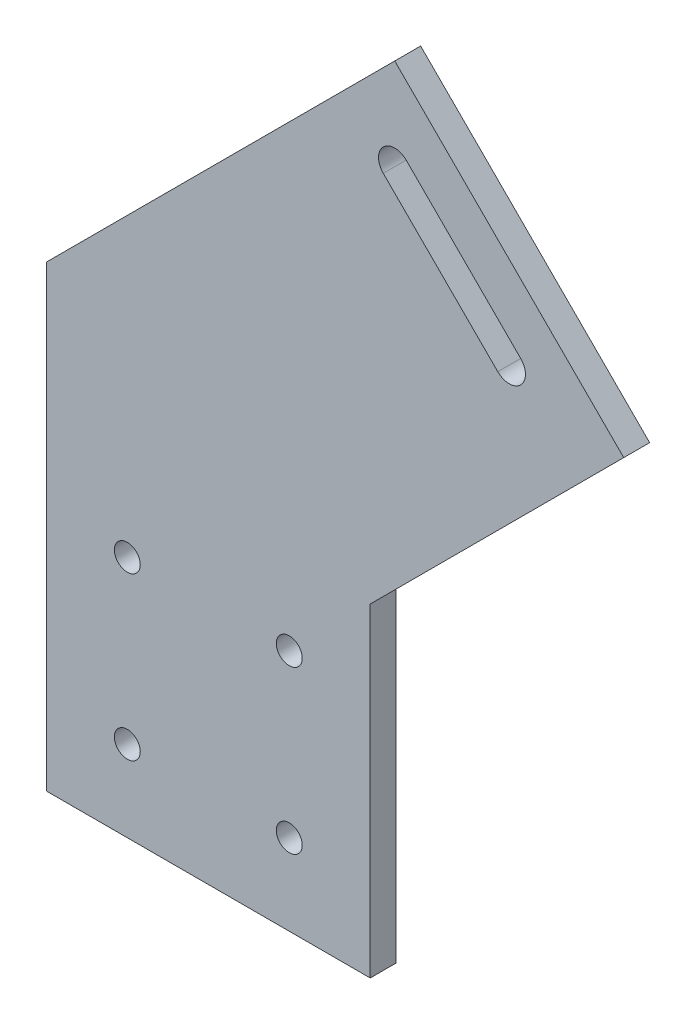
ISO-10303-21;
HEADER;
FILE_DESCRIPTION(('STEP AP214'),'2;1');
FILE_NAME('part.step','',(''),(''),'','','');
FILE_SCHEMA(('AUTOMOTIVE_DESIGN { 1 0 10303 214 1 1 1 1 }'));
ENDSEC;
DATA;
#1=APPLICATION_CONTEXT('core data for automotive mechanical design processes');
#2=APPLICATION_PROTOCOL_DEFINITION('international standard','automotive_design',2000,#1);
#3=PRODUCT_CONTEXT('',#1,'mechanical');
#4=PRODUCT('Part','Part','',(#3));
#5=PRODUCT_RELATED_PRODUCT_CATEGORY('part','',(#4));
#6=PRODUCT_DEFINITION_FORMATION('','',#4);
#7=PRODUCT_DEFINITION_CONTEXT('part definition',#1,'design');
#8=PRODUCT_DEFINITION('design','',#6,#7);
#9=PRODUCT_DEFINITION_SHAPE('','',#8);
#10=(LENGTH_UNIT() NAMED_UNIT(*) SI_UNIT(.MILLI.,.METRE.));
#11=(NAMED_UNIT(*) PLANE_ANGLE_UNIT() SI_UNIT($,.RADIAN.));
#12=(NAMED_UNIT(*) SI_UNIT($,.STERADIAN.) SOLID_ANGLE_UNIT());
#13=UNCERTAINTY_MEASURE_WITH_UNIT(LENGTH_MEASURE(1.E-05),#10,'distance_accuracy_value','');
#14=(GEOMETRIC_REPRESENTATION_CONTEXT(3) GLOBAL_UNCERTAINTY_ASSIGNED_CONTEXT((#13)) GLOBAL_UNIT_ASSIGNED_CONTEXT((#10,
#11,#12)) REPRESENTATION_CONTEXT('',''));
#15=CARTESIAN_POINT('',(0.,0.,0.));
#16=DIRECTION('',(0.,0.,1.));
#17=DIRECTION('',(1.,0.,0.));
#18=AXIS2_PLACEMENT_3D('',#15,#16,#17);
#19=CARTESIAN_POINT('',(0.,0.,4.));
#20=DIRECTION('',(0.,0.,-1.));
#21=DIRECTION('',(-1.,0.,0.));
#22=AXIS2_PLACEMENT_3D('',#19,#20,#21);
#23=PLANE('',#22);
#24=DIRECTION('',(0.,-1.,0.));
#25=VECTOR('',#24,1.);
#26=CARTESIAN_POINT('',(-25.,40.,4.));
#27=LINE('',#26,#25);
#28=CARTESIAN_POINT('',(-25.,60.7106781186547,4.));
#29=VERTEX_POINT('',#28);
#30=CARTESIAN_POINT('',(-25.,-9.99999999999999,4.));
#31=VERTEX_POINT('',#30);
#32=EDGE_CURVE('E153',#29,#31,#27,.T.);
#33=ORIENTED_EDGE('',*,*,#32,.T.);
#34=DIRECTION('',(1.,0.,0.));
#35=VECTOR('',#34,1.);
#36=CARTESIAN_POINT('',(-25.,-9.99999999999999,4.));
#37=LINE('',#36,#35);
#38=CARTESIAN_POINT('',(25.,-9.99999999999999,4.));
#39=VERTEX_POINT('',#38);
#40=EDGE_CURVE('E155',#31,#39,#37,.T.);
#41=ORIENTED_EDGE('',*,*,#40,.T.);
#42=DIRECTION('',(0.,1.,0.));
#43=VECTOR('',#42,1.);
#44=CARTESIAN_POINT('',(25.,-9.99999999999999,4.));
#45=LINE('',#44,#43);
#46=CARTESIAN_POINT('',(25.,40.,4.));
#47=VERTEX_POINT('',#46);
#48=EDGE_CURVE('E158',#39,#47,#45,.T.);
#49=ORIENTED_EDGE('',*,*,#48,.T.);
#50=DIRECTION('',(0.707106781186549,0.707106781186546,0.));
#51=VECTOR('',#50,1.);
#52=CARTESIAN_POINT('',(25.,40.,4.));
#53=LINE('',#52,#51);
#54=CARTESIAN_POINT('',(64.1386172558174,79.1386172558173,4.));
#55=VERTEX_POINT('',#54);
#56=EDGE_CURVE('E160',#47,#55,#53,.T.);
#57=ORIENTED_EDGE('',*,*,#56,.T.);
#58=DIRECTION('',(-0.707106781186548,0.707106781186547,0.));
#59=VECTOR('',#58,1.);
#60=CARTESIAN_POINT('',(28.7832781964899,114.493956315145,4.));
#61=LINE('',#60,#59);
#62=CARTESIAN_POINT('',(28.7832781964899,114.493956315145,4.));
#63=VERTEX_POINT('',#62);
#64=EDGE_CURVE('E162',#55,#63,#61,.T.);
#65=ORIENTED_EDGE('',*,*,#64,.T.);
#66=DIRECTION('',(-0.707106781186548,-0.707106781186547,0.));
#67=VECTOR('',#66,1.);
#68=CARTESIAN_POINT('',(28.7832781964899,114.493956315145,4.));
#69=LINE('',#68,#67);
#70=EDGE_CURVE('E164',#63,#29,#69,.T.);
#71=ORIENTED_EDGE('',*,*,#70,.T.);
#72=EDGE_LOOP('',(#33,#41,#49,#57,#65,#71));
#73=FACE_BOUND('',#72,.T.);
#74=CARTESIAN_POINT('',(46.4609477261536,82.67415116175,4.));
#75=DIRECTION('',(0.,0.,1.));
#76=DIRECTION('',(1.,0.,0.));
#77=AXIS2_PLACEMENT_3D('',#74,#75,#76);
#78=CIRCLE('',#77,2.5);
#79=CARTESIAN_POINT('',(44.6931807731872,80.9063842087836,4.));
#80=VERTEX_POINT('',#79);
#81=CARTESIAN_POINT('',(48.22871467912,84.4419181147164,4.));
#82=VERTEX_POINT('',#81);
#83=EDGE_CURVE('E114',#80,#82,#78,.T.);
#84=ORIENTED_EDGE('',*,*,#83,.F.);
#85=DIRECTION('',(0.707106781186548,-0.707106781186547,0.));
#86=VECTOR('',#85,1.);
#87=CARTESIAN_POINT('',(27.0155112435235,98.5840537384473,4.));
#88=LINE('',#87,#86);
#89=CARTESIAN_POINT('',(27.0155112435235,98.5840537384473,4.));
#90=VERTEX_POINT('',#89);
#91=EDGE_CURVE('E137',#90,#80,#88,.T.);
#92=ORIENTED_EDGE('',*,*,#91,.F.);
#93=CARTESIAN_POINT('',(28.7832781964899,100.351820691414,4.));
#94=DIRECTION('',(0.,0.,1.));
#95=DIRECTION('',(1.,0.,0.));
#96=AXIS2_PLACEMENT_3D('',#93,#94,#95);
#97=CIRCLE('',#96,2.50000000000001);
#98=CARTESIAN_POINT('',(30.5510451494563,102.11958764438,4.));
#99=VERTEX_POINT('',#98);
#100=EDGE_CURVE('E135',#99,#90,#97,.T.);
#101=ORIENTED_EDGE('',*,*,#100,.F.);
#102=DIRECTION('',(-0.707106781186547,0.707106781186548,0.));
#103=VECTOR('',#102,1.);
#104=CARTESIAN_POINT('',(48.22871467912,84.4419181147164,4.));
#105=LINE('',#104,#103);
#106=EDGE_CURVE('E122',#82,#99,#105,.T.);
#107=ORIENTED_EDGE('',*,*,#106,.F.);
#108=EDGE_LOOP('',(#84,#92,#101,#107));
#109=FACE_BOUND('',#108,.T.);
#110=CARTESIAN_POINT('',(-12.5,27.5,4.));
#111=DIRECTION('',(0.,0.,1.));
#112=DIRECTION('',(1.,0.,0.));
#113=AXIS2_PLACEMENT_3D('',#110,#111,#112);
#114=CIRCLE('',#113,2.);
#115=CARTESIAN_POINT('',(-10.5,27.5,4.));
#116=VERTEX_POINT('',#115);
#117=EDGE_CURVE('E143',#116,#116,#114,.T.);
#118=ORIENTED_EDGE('',*,*,#117,.F.);
#119=EDGE_LOOP('',(#118));
#120=FACE_BOUND('',#119,.T.);
#121=CARTESIAN_POINT('',(12.5,27.5,4.));
#122=DIRECTION('',(0.,0.,1.));
#123=DIRECTION('',(1.,0.,0.));
#124=AXIS2_PLACEMENT_3D('',#121,#122,#123);
#125=CIRCLE('',#124,2.);
#126=CARTESIAN_POINT('',(14.5,27.5,4.));
#127=VERTEX_POINT('',#126);
#128=EDGE_CURVE('E281',#127,#127,#125,.T.);
#129=ORIENTED_EDGE('',*,*,#128,.F.);
#130=EDGE_LOOP('',(#129));
#131=FACE_BOUND('',#130,.T.);
#132=CARTESIAN_POINT('',(12.5,2.5,4.));
#133=DIRECTION('',(0.,0.,1.));
#134=DIRECTION('',(1.,0.,0.));
#135=AXIS2_PLACEMENT_3D('',#132,#133,#134);
#136=CIRCLE('',#135,2.);
#137=CARTESIAN_POINT('',(14.5,2.5,4.));
#138=VERTEX_POINT('',#137);
#139=EDGE_CURVE('E275',#138,#138,#136,.T.);
#140=ORIENTED_EDGE('',*,*,#139,.F.);
#141=EDGE_LOOP('',(#140));
#142=FACE_BOUND('',#141,.T.);
#143=CARTESIAN_POINT('',(-12.5,2.5,4.));
#144=DIRECTION('',(0.,0.,1.));
#145=DIRECTION('',(1.,0.,0.));
#146=AXIS2_PLACEMENT_3D('',#143,#144,#145);
#147=CIRCLE('',#146,2.);
#148=CARTESIAN_POINT('',(-10.5,2.5,4.));
#149=VERTEX_POINT('',#148);
#150=EDGE_CURVE('E266',#149,#149,#147,.T.);
#151=ORIENTED_EDGE('',*,*,#150,.F.);
#152=EDGE_LOOP('',(#151));
#153=FACE_BOUND('',#152,.T.);
#154=ADVANCED_FACE('F37',(#73,#109,#120,#131,#142,#153),#23,.F.);
#155=CARTESIAN_POINT('',(0.,0.,0.));
#156=DIRECTION('',(0.,0.,-1.));
#157=DIRECTION('',(-1.,0.,0.));
#158=AXIS2_PLACEMENT_3D('',#155,#156,#157);
#159=PLANE('',#158);
#160=CARTESIAN_POINT('',(12.5,2.5,0.));
#161=DIRECTION('',(0.,0.,1.));
#162=DIRECTION('',(1.,0.,0.));
#163=AXIS2_PLACEMENT_3D('',#160,#161,#162);
#164=CIRCLE('',#163,2.);
#165=CARTESIAN_POINT('',(14.5,2.5,0.));
#166=VERTEX_POINT('',#165);
#167=EDGE_CURVE('E272',#166,#166,#164,.T.);
#168=ORIENTED_EDGE('',*,*,#167,.T.);
#169=EDGE_LOOP('',(#168));
#170=FACE_BOUND('',#169,.T.);
#171=CARTESIAN_POINT('',(-12.5,27.5,0.));
#172=DIRECTION('',(0.,0.,1.));
#173=DIRECTION('',(1.,0.,0.));
#174=AXIS2_PLACEMENT_3D('',#171,#172,#173);
#175=CIRCLE('',#174,2.);
#176=CARTESIAN_POINT('',(-10.5,27.5,0.));
#177=VERTEX_POINT('',#176);
#178=EDGE_CURVE('E284',#177,#177,#175,.T.);
#179=ORIENTED_EDGE('',*,*,#178,.T.);
#180=EDGE_LOOP('',(#179));
#181=FACE_BOUND('',#180,.T.);
#182=DIRECTION('',(0.,-1.,0.));
#183=VECTOR('',#182,1.);
#184=CARTESIAN_POINT('',(-25.,-9.99999999999999,0.));
#185=LINE('',#184,#183);
#186=CARTESIAN_POINT('',(-25.,60.7106781186547,0.));
#187=VERTEX_POINT('',#186);
#188=CARTESIAN_POINT('',(-25.,-9.99999999999999,0.));
#189=VERTEX_POINT('',#188);
#190=EDGE_CURVE('E130',#187,#189,#185,.T.);
#191=ORIENTED_EDGE('',*,*,#190,.F.);
#192=DIRECTION('',(-0.707106781186548,-0.707106781186547,0.));
#193=VECTOR('',#192,1.);
#194=CARTESIAN_POINT('',(28.7832781964899,114.493956315145,0.));
#195=LINE('',#194,#193);
#196=CARTESIAN_POINT('',(28.7832781964899,114.493956315145,0.));
#197=VERTEX_POINT('',#196);
#198=EDGE_CURVE('E156',#197,#187,#195,.T.);
#199=ORIENTED_EDGE('',*,*,#198,.F.);
#200=DIRECTION('',(-0.707106781186548,0.707106781186547,0.));
#201=VECTOR('',#200,1.);
#202=CARTESIAN_POINT('',(28.7832781964899,114.493956315145,0.));
#203=LINE('',#202,#201);
#204=CARTESIAN_POINT('',(64.1386172558174,79.1386172558173,0.));
#205=VERTEX_POINT('',#204);
#206=EDGE_CURVE('E174',#205,#197,#203,.T.);
#207=ORIENTED_EDGE('',*,*,#206,.F.);
#208=DIRECTION('',(0.707106781186549,0.707106781186546,0.));
#209=VECTOR('',#208,1.);
#210=CARTESIAN_POINT('',(25.,40.,0.));
#211=LINE('',#210,#209);
#212=CARTESIAN_POINT('',(25.,40.,0.));
#213=VERTEX_POINT('',#212);
#214=EDGE_CURVE('E172',#213,#205,#211,.T.);
#215=ORIENTED_EDGE('',*,*,#214,.F.);
#216=DIRECTION('',(0.,1.,0.));
#217=VECTOR('',#216,1.);
#218=CARTESIAN_POINT('',(25.,-9.99999999999999,0.));
#219=LINE('',#218,#217);
#220=CARTESIAN_POINT('',(25.,-9.99999999999999,0.));
#221=VERTEX_POINT('',#220);
#222=EDGE_CURVE('E170',#221,#213,#219,.T.);
#223=ORIENTED_EDGE('',*,*,#222,.F.);
#224=DIRECTION('',(1.,0.,0.));
#225=VECTOR('',#224,1.);
#226=CARTESIAN_POINT('',(-25.,-9.99999999999999,0.));
#227=LINE('',#226,#225);
#228=EDGE_CURVE('E168',#189,#221,#227,.T.);
#229=ORIENTED_EDGE('',*,*,#228,.F.);
#230=EDGE_LOOP('',(#191,#199,#207,#215,#223,#229));
#231=FACE_BOUND('',#230,.T.);
#232=DIRECTION('',(0.707106781186548,-0.707106781186547,0.));
#233=VECTOR('',#232,1.);
#234=CARTESIAN_POINT('',(27.0155112435235,98.5840537384473,0.));
#235=LINE('',#234,#233);
#236=CARTESIAN_POINT('',(27.0155112435235,98.5840537384473,0.));
#237=VERTEX_POINT('',#236);
#238=CARTESIAN_POINT('',(44.6931807731872,80.9063842087836,0.));
#239=VERTEX_POINT('',#238);
#240=EDGE_CURVE('E123',#237,#239,#235,.T.);
#241=ORIENTED_EDGE('',*,*,#240,.T.);
#242=CARTESIAN_POINT('',(46.4609477261536,82.67415116175,0.));
#243=DIRECTION('',(0.,0.,1.));
#244=DIRECTION('',(1.,0.,0.));
#245=AXIS2_PLACEMENT_3D('',#242,#243,#244);
#246=CIRCLE('',#245,2.5);
#247=CARTESIAN_POINT('',(48.22871467912,84.4419181147164,0.));
#248=VERTEX_POINT('',#247);
#249=EDGE_CURVE('E60',#239,#248,#246,.T.);
#250=ORIENTED_EDGE('',*,*,#249,.T.);
#251=DIRECTION('',(-0.707106781186547,0.707106781186548,0.));
#252=VECTOR('',#251,1.);
#253=CARTESIAN_POINT('',(48.22871467912,84.4419181147164,0.));
#254=LINE('',#253,#252);
#255=CARTESIAN_POINT('',(30.5510451494563,102.11958764438,0.));
#256=VERTEX_POINT('',#255);
#257=EDGE_CURVE('E129',#248,#256,#254,.T.);
#258=ORIENTED_EDGE('',*,*,#257,.T.);
#259=CARTESIAN_POINT('',(28.7832781964899,100.351820691414,0.));
#260=DIRECTION('',(0.,0.,1.));
#261=DIRECTION('',(1.,0.,0.));
#262=AXIS2_PLACEMENT_3D('',#259,#260,#261);
#263=CIRCLE('',#262,2.50000000000001);
#264=EDGE_CURVE('E145',#256,#237,#263,.T.);
#265=ORIENTED_EDGE('',*,*,#264,.T.);
#266=EDGE_LOOP('',(#241,#250,#258,#265));
#267=FACE_BOUND('',#266,.T.);
#268=CARTESIAN_POINT('',(12.5,27.5,0.));
#269=DIRECTION('',(0.,0.,1.));
#270=DIRECTION('',(1.,0.,0.));
#271=AXIS2_PLACEMENT_3D('',#268,#269,#270);
#272=CIRCLE('',#271,2.);
#273=CARTESIAN_POINT('',(14.5,27.5,0.));
#274=VERTEX_POINT('',#273);
#275=EDGE_CURVE('E278',#274,#274,#272,.T.);
#276=ORIENTED_EDGE('',*,*,#275,.T.);
#277=EDGE_LOOP('',(#276));
#278=FACE_BOUND('',#277,.T.);
#279=CARTESIAN_POINT('',(-12.5,2.5,0.));
#280=DIRECTION('',(0.,0.,1.));
#281=DIRECTION('',(1.,0.,0.));
#282=AXIS2_PLACEMENT_3D('',#279,#280,#281);
#283=CIRCLE('',#282,2.);
#284=CARTESIAN_POINT('',(-10.5,2.5,0.));
#285=VERTEX_POINT('',#284);
#286=EDGE_CURVE('E269',#285,#285,#283,.T.);
#287=ORIENTED_EDGE('',*,*,#286,.T.);
#288=EDGE_LOOP('',(#287));
#289=FACE_BOUND('',#288,.T.);
#290=ADVANCED_FACE('F200',(#170,#181,#231,#267,#278,#289),#159,.T.);
#291=CARTESIAN_POINT('',(-25.,-9.99999999999999,4.));
#292=DIRECTION('',(1.,0.,0.));
#293=DIRECTION('',(0.,0.,-1.));
#294=AXIS2_PLACEMENT_3D('',#291,#292,#293);
#295=PLANE('',#294);
#296=ORIENTED_EDGE('',*,*,#190,.T.);
#297=DIRECTION('',(0.,0.,-1.));
#298=VECTOR('',#297,1.);
#299=CARTESIAN_POINT('',(-25.,-9.99999999999999,4.));
#300=LINE('',#299,#298);
#301=EDGE_CURVE('E11',#31,#189,#300,.T.);
#302=ORIENTED_EDGE('',*,*,#301,.F.);
#303=ORIENTED_EDGE('',*,*,#32,.F.);
#304=DIRECTION('',(0.,0.,-1.));
#305=VECTOR('',#304,1.);
#306=CARTESIAN_POINT('',(-25.,60.7106781186547,4.));
#307=LINE('',#306,#305);
#308=EDGE_CURVE('E166',#29,#187,#307,.T.);
#309=ORIENTED_EDGE('',*,*,#308,.T.);
#310=EDGE_LOOP('',(#296,#302,#303,#309));
#311=FACE_BOUND('',#310,.T.);
#312=ADVANCED_FACE('F39',(#311),#295,.F.);
#313=CARTESIAN_POINT('',(-25.,-9.99999999999999,4.));
#314=DIRECTION('',(0.,1.,0.));
#315=DIRECTION('',(0.,0.,1.));
#316=AXIS2_PLACEMENT_3D('',#313,#314,#315);
#317=PLANE('',#316);
#318=ORIENTED_EDGE('',*,*,#228,.T.);
#319=DIRECTION('',(0.,0.,-1.));
#320=VECTOR('',#319,1.);
#321=CARTESIAN_POINT('',(25.,-9.99999999999999,4.));
#322=LINE('',#321,#320);
#323=EDGE_CURVE('E45',#39,#221,#322,.T.);
#324=ORIENTED_EDGE('',*,*,#323,.F.);
#325=ORIENTED_EDGE('',*,*,#40,.F.);
#326=ORIENTED_EDGE('',*,*,#301,.T.);
#327=EDGE_LOOP('',(#318,#324,#325,#326));
#328=FACE_BOUND('',#327,.T.);
#329=ADVANCED_FACE('F217',(#328),#317,.F.);
#330=CARTESIAN_POINT('',(25.,-9.99999999999999,4.));
#331=DIRECTION('',(-1.,0.,0.));
#332=DIRECTION('',(0.,0.,1.));
#333=AXIS2_PLACEMENT_3D('',#330,#331,#332);
#334=PLANE('',#333);
#335=ORIENTED_EDGE('',*,*,#222,.T.);
#336=DIRECTION('',(0.,0.,-1.));
#337=VECTOR('',#336,1.);
#338=CARTESIAN_POINT('',(25.,40.,4.));
#339=LINE('',#338,#337);
#340=EDGE_CURVE('E186',#47,#213,#339,.T.);
#341=ORIENTED_EDGE('',*,*,#340,.F.);
#342=ORIENTED_EDGE('',*,*,#48,.F.);
#343=ORIENTED_EDGE('',*,*,#323,.T.);
#344=EDGE_LOOP('',(#335,#341,#342,#343));
#345=FACE_BOUND('',#344,.T.);
#346=ADVANCED_FACE('F193',(#345),#334,.F.);
#347=CARTESIAN_POINT('',(25.,40.,4.));
#348=DIRECTION('',(-0.707106781186546,0.707106781186549,0.));
#349=DIRECTION('',(-0.707106781186549,-0.707106781186546,0.));
#350=AXIS2_PLACEMENT_3D('',#347,#348,#349);
#351=PLANE('',#350);
#352=ORIENTED_EDGE('',*,*,#214,.T.);
#353=DIRECTION('',(0.,0.,-1.));
#354=VECTOR('',#353,1.);
#355=CARTESIAN_POINT('',(64.1386172558174,79.1386172558173,4.));
#356=LINE('',#355,#354);
#357=EDGE_CURVE('E183',#55,#205,#356,.T.);
#358=ORIENTED_EDGE('',*,*,#357,.F.);
#359=ORIENTED_EDGE('',*,*,#56,.F.);
#360=ORIENTED_EDGE('',*,*,#340,.T.);
#361=EDGE_LOOP('',(#352,#358,#359,#360));
#362=FACE_BOUND('',#361,.T.);
#363=ADVANCED_FACE('F206',(#362),#351,.F.);
#364=CARTESIAN_POINT('',(28.7832781964899,114.493956315145,4.));
#365=DIRECTION('',(-0.707106781186547,-0.707106781186548,0.));
#366=DIRECTION('',(0.707106781186548,-0.707106781186547,0.));
#367=AXIS2_PLACEMENT_3D('',#364,#365,#366);
#368=PLANE('',#367);
#369=ORIENTED_EDGE('',*,*,#206,.T.);
#370=DIRECTION('',(0.,0.,-1.));
#371=VECTOR('',#370,1.);
#372=CARTESIAN_POINT('',(28.7832781964899,114.493956315145,4.));
#373=LINE('',#372,#371);
#374=EDGE_CURVE('E180',#63,#197,#373,.T.);
#375=ORIENTED_EDGE('',*,*,#374,.F.);
#376=ORIENTED_EDGE('',*,*,#64,.F.);
#377=ORIENTED_EDGE('',*,*,#357,.T.);
#378=EDGE_LOOP('',(#369,#375,#376,#377));
#379=FACE_BOUND('',#378,.T.);
#380=ADVANCED_FACE('F210',(#379),#368,.F.);
#381=CARTESIAN_POINT('',(28.7832781964899,114.493956315145,4.));
#382=DIRECTION('',(0.707106781186547,-0.707106781186548,0.));
#383=DIRECTION('',(0.707106781186548,0.707106781186547,0.));
#384=AXIS2_PLACEMENT_3D('',#381,#382,#383);
#385=PLANE('',#384);
#386=ORIENTED_EDGE('',*,*,#198,.T.);
#387=ORIENTED_EDGE('',*,*,#308,.F.);
#388=ORIENTED_EDGE('',*,*,#70,.F.);
#389=ORIENTED_EDGE('',*,*,#374,.T.);
#390=EDGE_LOOP('',(#386,#387,#388,#389));
#391=FACE_BOUND('',#390,.T.);
#392=ADVANCED_FACE('F220',(#391),#385,.F.);
#393=CARTESIAN_POINT('',(46.4609477261536,82.67415116175,4.));
#394=DIRECTION('',(0.,0.,-1.));
#395=DIRECTION('',(-1.,0.,0.));
#396=AXIS2_PLACEMENT_3D('',#393,#394,#395);
#397=CYLINDRICAL_SURFACE('',#396,2.5);
#398=ORIENTED_EDGE('',*,*,#249,.F.);
#399=DIRECTION('',(0.,0.,-1.));
#400=VECTOR('',#399,1.);
#401=CARTESIAN_POINT('',(44.6931807731872,80.9063842087836,4.));
#402=LINE('',#401,#400);
#403=EDGE_CURVE('E118',#80,#239,#402,.T.);
#404=ORIENTED_EDGE('',*,*,#403,.F.);
#405=ORIENTED_EDGE('',*,*,#83,.T.);
#406=DIRECTION('',(0.,0.,-1.));
#407=VECTOR('',#406,1.);
#408=CARTESIAN_POINT('',(48.22871467912,84.4419181147164,4.));
#409=LINE('',#408,#407);
#410=EDGE_CURVE('E117',#82,#248,#409,.T.);
#411=ORIENTED_EDGE('',*,*,#410,.T.);
#412=EDGE_LOOP('',(#398,#404,#405,#411));
#413=FACE_BOUND('',#412,.T.);
#414=ADVANCED_FACE('F116',(#413),#397,.F.);
#415=CARTESIAN_POINT('',(48.22871467912,84.4419181147164,4.));
#416=DIRECTION('',(-0.707106781186548,-0.707106781186547,0.));
#417=DIRECTION('',(0.707106781186547,-0.707106781186548,0.));
#418=AXIS2_PLACEMENT_3D('',#415,#416,#417);
#419=PLANE('',#418);
#420=ORIENTED_EDGE('',*,*,#257,.F.);
#421=ORIENTED_EDGE('',*,*,#410,.F.);
#422=ORIENTED_EDGE('',*,*,#106,.T.);
#423=DIRECTION('',(0.,0.,-1.));
#424=VECTOR('',#423,1.);
#425=CARTESIAN_POINT('',(30.5510451494563,102.11958764438,4.));
#426=LINE('',#425,#424);
#427=EDGE_CURVE('E131',#99,#256,#426,.T.);
#428=ORIENTED_EDGE('',*,*,#427,.T.);
#429=EDGE_LOOP('',(#420,#421,#422,#428));
#430=FACE_BOUND('',#429,.T.);
#431=ADVANCED_FACE('F126',(#430),#419,.T.);
#432=CARTESIAN_POINT('',(28.7832781964899,100.351820691414,4.));
#433=DIRECTION('',(0.,0.,-1.));
#434=DIRECTION('',(-1.,0.,0.));
#435=AXIS2_PLACEMENT_3D('',#432,#433,#434);
#436=CYLINDRICAL_SURFACE('',#435,2.50000000000001);
#437=ORIENTED_EDGE('',*,*,#264,.F.);
#438=ORIENTED_EDGE('',*,*,#427,.F.);
#439=ORIENTED_EDGE('',*,*,#100,.T.);
#440=DIRECTION('',(0.,0.,-1.));
#441=VECTOR('',#440,1.);
#442=CARTESIAN_POINT('',(27.0155112435235,98.5840537384473,4.));
#443=LINE('',#442,#441);
#444=EDGE_CURVE('E52',#90,#237,#443,.T.);
#445=ORIENTED_EDGE('',*,*,#444,.T.);
#446=EDGE_LOOP('',(#437,#438,#439,#445));
#447=FACE_BOUND('',#446,.T.);
#448=ADVANCED_FACE('F239',(#447),#436,.F.);
#449=CARTESIAN_POINT('',(27.0155112435235,98.5840537384473,4.));
#450=DIRECTION('',(0.707106781186547,0.707106781186548,0.));
#451=DIRECTION('',(-0.707106781186548,0.707106781186547,0.));
#452=AXIS2_PLACEMENT_3D('',#449,#450,#451);
#453=PLANE('',#452);
#454=ORIENTED_EDGE('',*,*,#240,.F.);
#455=ORIENTED_EDGE('',*,*,#444,.F.);
#456=ORIENTED_EDGE('',*,*,#91,.T.);
#457=ORIENTED_EDGE('',*,*,#403,.T.);
#458=EDGE_LOOP('',(#454,#455,#456,#457));
#459=FACE_BOUND('',#458,.T.);
#460=ADVANCED_FACE('F242',(#459),#453,.T.);
#461=CARTESIAN_POINT('',(-12.5,27.5,4.));
#462=DIRECTION('',(0.,0.,-1.));
#463=DIRECTION('',(-1.,0.,0.));
#464=AXIS2_PLACEMENT_3D('',#461,#462,#463);
#465=CYLINDRICAL_SURFACE('',#464,2.);
#466=ORIENTED_EDGE('',*,*,#117,.T.);
#467=EDGE_LOOP('',(#466));
#468=FACE_BOUND('',#467,.T.);
#469=ORIENTED_EDGE('',*,*,#178,.F.);
#470=EDGE_LOOP('',(#469));
#471=FACE_BOUND('',#470,.T.);
#472=ADVANCED_FACE('F246',(#468,#471),#465,.F.);
#473=CARTESIAN_POINT('',(12.5,27.5,4.));
#474=DIRECTION('',(0.,0.,-1.));
#475=DIRECTION('',(-1.,0.,0.));
#476=AXIS2_PLACEMENT_3D('',#473,#474,#475);
#477=CYLINDRICAL_SURFACE('',#476,2.);
#478=ORIENTED_EDGE('',*,*,#128,.T.);
#479=EDGE_LOOP('',(#478));
#480=FACE_BOUND('',#479,.T.);
#481=ORIENTED_EDGE('',*,*,#275,.F.);
#482=EDGE_LOOP('',(#481));
#483=FACE_BOUND('',#482,.T.);
#484=ADVANCED_FACE('F249',(#480,#483),#477,.F.);
#485=CARTESIAN_POINT('',(12.5,2.5,4.));
#486=DIRECTION('',(0.,0.,-1.));
#487=DIRECTION('',(-1.,0.,0.));
#488=AXIS2_PLACEMENT_3D('',#485,#486,#487);
#489=CYLINDRICAL_SURFACE('',#488,2.);
#490=ORIENTED_EDGE('',*,*,#139,.T.);
#491=EDGE_LOOP('',(#490));
#492=FACE_BOUND('',#491,.T.);
#493=ORIENTED_EDGE('',*,*,#167,.F.);
#494=EDGE_LOOP('',(#493));
#495=FACE_BOUND('',#494,.T.);
#496=ADVANCED_FACE('F253',(#492,#495),#489,.F.);
#497=CARTESIAN_POINT('',(-12.5,2.5,4.));
#498=DIRECTION('',(0.,0.,-1.));
#499=DIRECTION('',(-1.,0.,0.));
#500=AXIS2_PLACEMENT_3D('',#497,#498,#499);
#501=CYLINDRICAL_SURFACE('',#500,2.);
#502=ORIENTED_EDGE('',*,*,#150,.T.);
#503=EDGE_LOOP('',(#502));
#504=FACE_BOUND('',#503,.T.);
#505=ORIENTED_EDGE('',*,*,#286,.F.);
#506=EDGE_LOOP('',(#505));
#507=FACE_BOUND('',#506,.T.);
#508=ADVANCED_FACE('F257',(#504,#507),#501,.F.);
#509=CLOSED_SHELL('',(#154,#290,#312,#329,#346,#363,#380,#392,#414,#431,#448,#460,#472,#484,
#496,#508));
#510=MANIFOLD_SOLID_BREP('B2',#509);
#511=ADVANCED_BREP_SHAPE_REPRESENTATION('',(#18,#510),#14);
#512=SHAPE_DEFINITION_REPRESENTATION(#9,#511);
ENDSEC;
END-ISO-10303-21;
